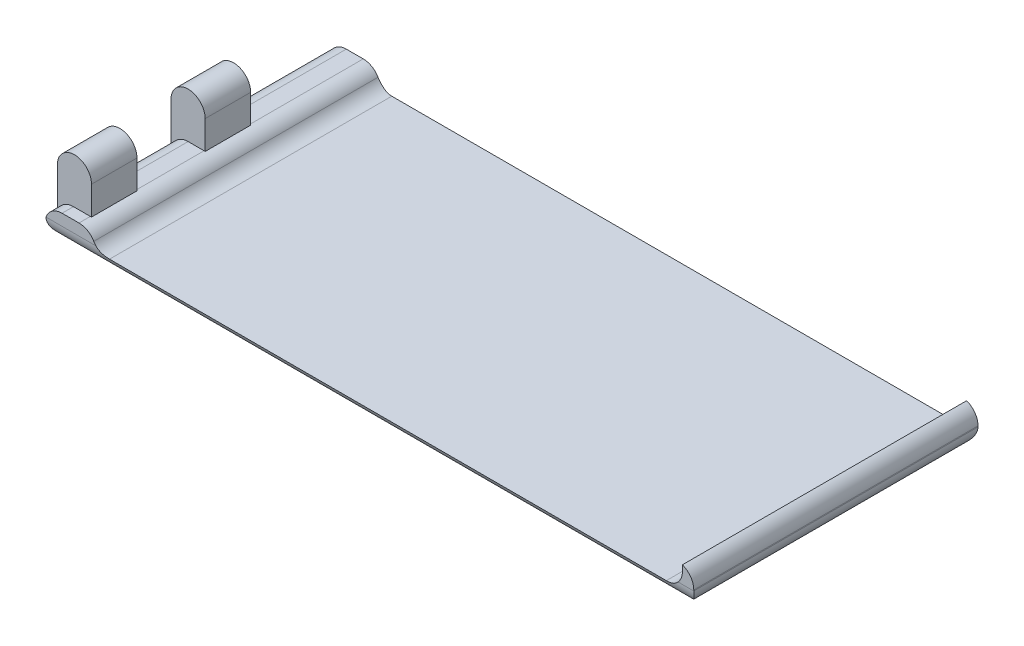
ISO-10303-21;
HEADER;
FILE_DESCRIPTION(('STEP AP214'),'2;1');
FILE_NAME('part.step','',(''),(''),'','','');
FILE_SCHEMA(('AUTOMOTIVE_DESIGN { 1 0 10303 214 1 1 1 1 }'));
ENDSEC;
DATA;
#1=APPLICATION_CONTEXT('core data for automotive mechanical design processes');
#2=APPLICATION_PROTOCOL_DEFINITION('international standard','automotive_design',2000,#1);
#3=PRODUCT_CONTEXT('',#1,'mechanical');
#4=PRODUCT('Part','Part','',(#3));
#5=PRODUCT_RELATED_PRODUCT_CATEGORY('part','',(#4));
#6=PRODUCT_DEFINITION_FORMATION('','',#4);
#7=PRODUCT_DEFINITION_CONTEXT('part definition',#1,'design');
#8=PRODUCT_DEFINITION('design','',#6,#7);
#9=PRODUCT_DEFINITION_SHAPE('','',#8);
#10=(LENGTH_UNIT() NAMED_UNIT(*) SI_UNIT(.MILLI.,.METRE.));
#11=(NAMED_UNIT(*) PLANE_ANGLE_UNIT() SI_UNIT($,.RADIAN.));
#12=(NAMED_UNIT(*) SI_UNIT($,.STERADIAN.) SOLID_ANGLE_UNIT());
#13=UNCERTAINTY_MEASURE_WITH_UNIT(LENGTH_MEASURE(1.E-05),#10,'distance_accuracy_value','');
#14=(GEOMETRIC_REPRESENTATION_CONTEXT(3) GLOBAL_UNCERTAINTY_ASSIGNED_CONTEXT((#13)) GLOBAL_UNIT_ASSIGNED_CONTEXT((#10,
#11,#12)) REPRESENTATION_CONTEXT('',''));
#15=CARTESIAN_POINT('',(0.,0.,0.));
#16=DIRECTION('',(0.,0.,1.));
#17=DIRECTION('',(1.,0.,0.));
#18=AXIS2_PLACEMENT_3D('',#15,#16,#17);
#19=CARTESIAN_POINT('',(-56.975,2.,-25.));
#20=DIRECTION('',(1.,0.,0.));
#21=DIRECTION('',(0.,0.,-1.));
#22=AXIS2_PLACEMENT_3D('',#19,#20,#21);
#23=PLANE('',#22);
#24=DIRECTION('',(0.,0.,1.));
#25=VECTOR('',#24,1.);
#26=CARTESIAN_POINT('',(-56.975,3.,-25.));
#27=LINE('',#26,#25);
#28=CARTESIAN_POINT('',(-56.975,3.,15.));
#29=VERTEX_POINT('',#28);
#30=CARTESIAN_POINT('',(-56.975,3.,23.));
#31=VERTEX_POINT('',#30);
#32=EDGE_CURVE('E471',#29,#31,#27,.T.);
#33=ORIENTED_EDGE('',*,*,#32,.T.);
#34=DIRECTION('',(0.,-1.,0.));
#35=VECTOR('',#34,1.);
#36=CARTESIAN_POINT('',(-56.975,13.,23.));
#37=LINE('',#36,#35);
#38=CARTESIAN_POINT('',(-56.975,10.,23.));
#39=VERTEX_POINT('',#38);
#40=EDGE_CURVE('E614',#39,#31,#37,.T.);
#41=ORIENTED_EDGE('',*,*,#40,.F.);
#42=DIRECTION('',(0.,0.,1.));
#43=VECTOR('',#42,1.);
#44=CARTESIAN_POINT('',(-56.975,10.,15.));
#45=LINE('',#44,#43);
#46=CARTESIAN_POINT('',(-56.975,10.,15.));
#47=VERTEX_POINT('',#46);
#48=EDGE_CURVE('E279',#39,#47,#45,.F.);
#49=ORIENTED_EDGE('',*,*,#48,.T.);
#50=DIRECTION('',(0.,-1.,0.));
#51=VECTOR('',#50,1.);
#52=CARTESIAN_POINT('',(-56.975,13.,15.));
#53=LINE('',#52,#51);
#54=EDGE_CURVE('E600',#47,#29,#53,.T.);
#55=ORIENTED_EDGE('',*,*,#54,.T.);
#56=EDGE_LOOP('',(#33,#41,#49,#55));
#57=FACE_BOUND('',#56,.T.);
#58=ADVANCED_FACE('F40',(#57),#23,.F.);
#59=CARTESIAN_POINT('',(0.,5.,0.));
#60=DIRECTION('',(0.,1.,0.));
#61=DIRECTION('',(0.,0.,1.));
#62=AXIS2_PLACEMENT_3D('',#59,#60,#61);
#63=PLANE('',#62);
#64=DIRECTION('',(1.,0.,0.));
#65=VECTOR('',#64,1.);
#66=CARTESIAN_POINT('',(-56.975,5.,23.));
#67=LINE('',#66,#65);
#68=CARTESIAN_POINT('',(-54.1465728752538,5.,23.));
#69=VERTEX_POINT('',#68);
#70=CARTESIAN_POINT('',(-51.1711524227066,5.,23.));
#71=VERTEX_POINT('',#70);
#72=EDGE_CURVE('E591',#69,#71,#67,.T.);
#73=ORIENTED_EDGE('',*,*,#72,.F.);
#74=DIRECTION('',(0.,0.,-1.));
#75=VECTOR('',#74,1.);
#76=CARTESIAN_POINT('',(-54.1465728752538,5.,25.));
#77=LINE('',#76,#75);
#78=CARTESIAN_POINT('',(-54.1465728752538,5.,25.));
#79=VERTEX_POINT('',#78);
#80=EDGE_CURVE('E509',#69,#79,#77,.F.);
#81=ORIENTED_EDGE('',*,*,#80,.T.);
#82=DIRECTION('',(1.,0.,0.));
#83=VECTOR('',#82,1.);
#84=CARTESIAN_POINT('',(-56.975,5.,25.));
#85=LINE('',#84,#83);
#86=CARTESIAN_POINT('',(-51.1711524227066,5.,25.));
#87=VERTEX_POINT('',#86);
#88=EDGE_CURVE('E232',#79,#87,#85,.T.);
#89=ORIENTED_EDGE('',*,*,#88,.T.);
#90=DIRECTION('',(0.,0.,1.));
#91=VECTOR('',#90,1.);
#92=CARTESIAN_POINT('',(-51.1711524227066,5.,-25.));
#93=LINE('',#92,#91);
#94=EDGE_CURVE('E584',#87,#71,#93,.F.);
#95=ORIENTED_EDGE('',*,*,#94,.T.);
#96=EDGE_LOOP('',(#73,#81,#89,#95));
#97=FACE_BOUND('',#96,.T.);
#98=ADVANCED_FACE('F434',(#97),#63,.T.);
#99=DIRECTION('',(-1.,0.,0.));
#100=VECTOR('',#99,1.);
#101=CARTESIAN_POINT('',(-56.975,5.,15.));
#102=LINE('',#101,#100);
#103=CARTESIAN_POINT('',(-51.1711524227066,5.,15.));
#104=VERTEX_POINT('',#103);
#105=CARTESIAN_POINT('',(-53.975,5.,15.));
#106=VERTEX_POINT('',#105);
#107=EDGE_CURVE('E594',#104,#106,#102,.T.);
#108=ORIENTED_EDGE('',*,*,#107,.F.);
#109=DIRECTION('',(0.,0.,1.));
#110=VECTOR('',#109,1.);
#111=CARTESIAN_POINT('',(-51.1711524227066,5.,-25.));
#112=LINE('',#111,#110);
#113=CARTESIAN_POINT('',(-51.1711524227066,5.,3.));
#114=VERTEX_POINT('',#113);
#115=EDGE_CURVE('E581',#104,#114,#112,.F.);
#116=ORIENTED_EDGE('',*,*,#115,.T.);
#117=DIRECTION('',(1.,0.,0.));
#118=VECTOR('',#117,1.);
#119=CARTESIAN_POINT('',(-56.975,5.,3.));
#120=LINE('',#119,#118);
#121=CARTESIAN_POINT('',(-53.975,5.,3.));
#122=VERTEX_POINT('',#121);
#123=EDGE_CURVE('E622',#122,#114,#120,.T.);
#124=ORIENTED_EDGE('',*,*,#123,.F.);
#125=DIRECTION('',(0.,0.,1.));
#126=VECTOR('',#125,1.);
#127=CARTESIAN_POINT('',(-53.975,5.,15.));
#128=LINE('',#127,#126);
#129=EDGE_CURVE('E572',#122,#106,#128,.T.);
#130=ORIENTED_EDGE('',*,*,#129,.T.);
#131=EDGE_LOOP('',(#108,#116,#124,#130));
#132=FACE_BOUND('',#131,.T.);
#133=ADVANCED_FACE('F441',(#132),#63,.T.);
#134=CARTESIAN_POINT('',(-56.975,2.,25.));
#135=DIRECTION('',(0.,0.,-1.));
#136=DIRECTION('',(-1.,0.,0.));
#137=AXIS2_PLACEMENT_3D('',#134,#135,#136);
#138=PLANE('',#137);
#139=ORIENTED_EDGE('',*,*,#88,.F.);
#140=CARTESIAN_POINT('',(-54.1465728752538,2.,25.));
#141=DIRECTION('',(0.,0.,-1.));
#142=DIRECTION('',(-1.,0.,0.));
#143=AXIS2_PLACEMENT_3D('',#140,#141,#142);
#144=CIRCLE('',#143,3.);
#145=CARTESIAN_POINT('',(-56.975,3.,25.));
#146=VERTEX_POINT('',#145);
#147=EDGE_CURVE('E480',#79,#146,#144,.F.);
#148=ORIENTED_EDGE('',*,*,#147,.T.);
#149=DIRECTION('',(1.,0.,0.));
#150=VECTOR('',#149,1.);
#151=CARTESIAN_POINT('',(-56.975,3.,25.));
#152=LINE('',#151,#150);
#153=CARTESIAN_POINT('',(-48.2110679774998,3.,25.));
#154=VERTEX_POINT('',#153);
#155=EDGE_CURVE('E326',#146,#154,#152,.T.);
#156=ORIENTED_EDGE('',*,*,#155,.T.);
#157=CARTESIAN_POINT('',(-45.975,5.,25.));
#158=DIRECTION('',(0.,0.,-1.));
#159=DIRECTION('',(-1.,0.,0.));
#160=AXIS2_PLACEMENT_3D('',#157,#158,#159);
#161=CIRCLE('',#160,3.);
#162=CARTESIAN_POINT('',(-48.5730762113533,3.5,25.));
#163=VERTEX_POINT('',#162);
#164=EDGE_CURVE('E499',#154,#163,#161,.T.);
#165=ORIENTED_EDGE('',*,*,#164,.T.);
#166=CARTESIAN_POINT('',(-51.1711524227066,2.,25.));
#167=DIRECTION('',(0.,0.,-1.));
#168=DIRECTION('',(-1.,0.,0.));
#169=AXIS2_PLACEMENT_3D('',#166,#167,#168);
#170=CIRCLE('',#169,3.);
#171=EDGE_CURVE('E503',#163,#87,#170,.F.);
#172=ORIENTED_EDGE('',*,*,#171,.T.);
#173=EDGE_LOOP('',(#139,#148,#156,#165,#172));
#174=FACE_BOUND('',#173,.T.);
#175=ADVANCED_FACE('F458',(#174),#138,.F.);
#176=CARTESIAN_POINT('',(-56.975,2.,-25.));
#177=DIRECTION('',(0.,0.,1.));
#178=DIRECTION('',(1.,0.,0.));
#179=AXIS2_PLACEMENT_3D('',#176,#177,#178);
#180=PLANE('',#179);
#181=DIRECTION('',(0.,-1.,0.));
#182=VECTOR('',#181,1.);
#183=CARTESIAN_POINT('',(54.975,6.,-25.));
#184=LINE('',#183,#182);
#185=CARTESIAN_POINT('',(54.975,6.,-25.));
#186=VERTEX_POINT('',#185);
#187=CARTESIAN_POINT('',(54.975,5.,-25.));
#188=VERTEX_POINT('',#187);
#189=EDGE_CURVE('E224',#186,#188,#184,.T.);
#190=ORIENTED_EDGE('',*,*,#189,.F.);
#191=CARTESIAN_POINT('',(53.975,3.17157287525381,-25.));
#192=DIRECTION('',(0.,0.,1.));
#193=DIRECTION('',(1.,0.,0.));
#194=AXIS2_PLACEMENT_3D('',#191,#192,#193);
#195=CIRCLE('',#194,3.);
#196=CARTESIAN_POINT('',(56.975,3.17157287525381,-25.));
#197=VERTEX_POINT('',#196);
#198=EDGE_CURVE('E63',#186,#197,#195,.F.);
#199=ORIENTED_EDGE('',*,*,#198,.T.);
#200=DIRECTION('',(0.,-1.,0.));
#201=VECTOR('',#200,1.);
#202=CARTESIAN_POINT('',(56.975,2.,-25.));
#203=LINE('',#202,#201);
#204=CARTESIAN_POINT('',(56.975,3.,-25.));
#205=VERTEX_POINT('',#204);
#206=EDGE_CURVE('E258',#197,#205,#203,.T.);
#207=ORIENTED_EDGE('',*,*,#206,.T.);
#208=DIRECTION('',(-1.,0.,0.));
#209=VECTOR('',#208,1.);
#210=CARTESIAN_POINT('',(-56.975,3.,-25.));
#211=LINE('',#210,#209);
#212=CARTESIAN_POINT('',(54.2110679774998,3.,-25.));
#213=VERTEX_POINT('',#212);
#214=EDGE_CURVE('E292',#205,#213,#211,.T.);
#215=ORIENTED_EDGE('',*,*,#214,.T.);
#216=CARTESIAN_POINT('',(51.975,5.,-25.));
#217=DIRECTION('',(0.,0.,1.));
#218=DIRECTION('',(1.,0.,0.));
#219=AXIS2_PLACEMENT_3D('',#216,#217,#218);
#220=CIRCLE('',#219,3.);
#221=EDGE_CURVE('E227',#213,#188,#220,.T.);
#222=ORIENTED_EDGE('',*,*,#221,.T.);
#223=EDGE_LOOP('',(#190,#199,#207,#215,#222));
#224=FACE_BOUND('',#223,.T.);
#225=ADVANCED_FACE('F225',(#224),#180,.F.);
#226=CARTESIAN_POINT('',(-53.975,10.,15.));
#227=DIRECTION('',(0.,0.,-1.));
#228=DIRECTION('',(-1.,0.,0.));
#229=AXIS2_PLACEMENT_3D('',#226,#227,#228);
#230=CYLINDRICAL_SURFACE('',#229,3.);
#231=DIRECTION('',(0.,0.,1.));
#232=VECTOR('',#231,1.);
#233=CARTESIAN_POINT('',(-50.975,10.,15.));
#234=LINE('',#233,#232);
#235=CARTESIAN_POINT('',(-50.975,10.,15.));
#236=VERTEX_POINT('',#235);
#237=CARTESIAN_POINT('',(-50.975,10.,23.));
#238=VERTEX_POINT('',#237);
#239=EDGE_CURVE('E275',#236,#238,#234,.T.);
#240=ORIENTED_EDGE('',*,*,#239,.F.);
#241=CARTESIAN_POINT('',(-53.975,10.,15.));
#242=DIRECTION('',(0.,0.,1.));
#243=DIRECTION('',(1.,0.,0.));
#244=AXIS2_PLACEMENT_3D('',#241,#242,#243);
#245=CIRCLE('',#244,3.);
#246=EDGE_CURVE('E283',#47,#236,#245,.F.);
#247=ORIENTED_EDGE('',*,*,#246,.F.);
#248=ORIENTED_EDGE('',*,*,#48,.F.);
#249=CARTESIAN_POINT('',(-53.975,10.,23.));
#250=DIRECTION('',(0.,0.,-1.));
#251=DIRECTION('',(-1.,0.,0.));
#252=AXIS2_PLACEMENT_3D('',#249,#250,#251);
#253=CIRCLE('',#252,3.);
#254=EDGE_CURVE('E286',#238,#39,#253,.F.);
#255=ORIENTED_EDGE('',*,*,#254,.F.);
#256=EDGE_LOOP('',(#240,#247,#248,#255));
#257=FACE_BOUND('',#256,.T.);
#258=ADVANCED_FACE('F388',(#257),#230,.T.);
#259=DIRECTION('',(-1.,0.,0.));
#260=VECTOR('',#259,1.);
#261=CARTESIAN_POINT('',(-56.975,5.,-5.));
#262=LINE('',#261,#260);
#263=CARTESIAN_POINT('',(-51.1711524227066,5.,-5.));
#264=VERTEX_POINT('',#263);
#265=CARTESIAN_POINT('',(-54.1465728752538,5.,-5.));
#266=VERTEX_POINT('',#265);
#267=EDGE_CURVE('E564',#264,#266,#262,.T.);
#268=ORIENTED_EDGE('',*,*,#267,.F.);
#269=DIRECTION('',(0.,0.,1.));
#270=VECTOR('',#269,1.);
#271=CARTESIAN_POINT('',(-51.1711524227066,5.,-25.));
#272=LINE('',#271,#270);
#273=CARTESIAN_POINT('',(-51.1711524227066,5.,-25.));
#274=VERTEX_POINT('',#273);
#275=EDGE_CURVE('E576',#264,#274,#272,.F.);
#276=ORIENTED_EDGE('',*,*,#275,.T.);
#277=DIRECTION('',(-1.,0.,0.));
#278=VECTOR('',#277,1.);
#279=CARTESIAN_POINT('',(-56.975,5.,-25.));
#280=LINE('',#279,#278);
#281=CARTESIAN_POINT('',(-54.1465728752538,5.,-25.));
#282=VERTEX_POINT('',#281);
#283=EDGE_CURVE('E251',#274,#282,#280,.T.);
#284=ORIENTED_EDGE('',*,*,#283,.T.);
#285=DIRECTION('',(0.,0.,-1.));
#286=VECTOR('',#285,1.);
#287=CARTESIAN_POINT('',(-54.1465728752538,5.,-5.));
#288=LINE('',#287,#286);
#289=EDGE_CURVE('E567',#282,#266,#288,.F.);
#290=ORIENTED_EDGE('',*,*,#289,.T.);
#291=EDGE_LOOP('',(#268,#276,#284,#290));
#292=FACE_BOUND('',#291,.T.);
#293=ADVANCED_FACE('F444',(#292),#63,.T.);
#294=CARTESIAN_POINT('',(-53.975,10.,-5.));
#295=DIRECTION('',(0.,0.,-1.));
#296=DIRECTION('',(-1.,0.,0.));
#297=AXIS2_PLACEMENT_3D('',#294,#295,#296);
#298=CYLINDRICAL_SURFACE('',#297,3.);
#299=DIRECTION('',(0.,0.,1.));
#300=VECTOR('',#299,1.);
#301=CARTESIAN_POINT('',(-50.975,10.,-5.));
#302=LINE('',#301,#300);
#303=CARTESIAN_POINT('',(-50.975,10.,-5.));
#304=VERTEX_POINT('',#303);
#305=CARTESIAN_POINT('',(-50.975,10.,3.));
#306=VERTEX_POINT('',#305);
#307=EDGE_CURVE('E261',#304,#306,#302,.T.);
#308=ORIENTED_EDGE('',*,*,#307,.F.);
#309=CARTESIAN_POINT('',(-53.975,10.,-5.));
#310=DIRECTION('',(0.,0.,1.));
#311=DIRECTION('',(1.,0.,0.));
#312=AXIS2_PLACEMENT_3D('',#309,#310,#311);
#313=CIRCLE('',#312,3.);
#314=CARTESIAN_POINT('',(-56.975,10.,-5.));
#315=VERTEX_POINT('',#314);
#316=EDGE_CURVE('E269',#315,#304,#313,.F.);
#317=ORIENTED_EDGE('',*,*,#316,.F.);
#318=DIRECTION('',(0.,0.,1.));
#319=VECTOR('',#318,1.);
#320=CARTESIAN_POINT('',(-56.975,10.,-5.));
#321=LINE('',#320,#319);
#322=CARTESIAN_POINT('',(-56.975,10.,3.));
#323=VERTEX_POINT('',#322);
#324=EDGE_CURVE('E265',#323,#315,#321,.F.);
#325=ORIENTED_EDGE('',*,*,#324,.F.);
#326=CARTESIAN_POINT('',(-53.975,10.,3.));
#327=DIRECTION('',(0.,0.,-1.));
#328=DIRECTION('',(-1.,0.,0.));
#329=AXIS2_PLACEMENT_3D('',#326,#327,#328);
#330=CIRCLE('',#329,3.);
#331=EDGE_CURVE('E272',#306,#323,#330,.F.);
#332=ORIENTED_EDGE('',*,*,#331,.F.);
#333=EDGE_LOOP('',(#308,#317,#325,#332));
#334=FACE_BOUND('',#333,.T.);
#335=ADVANCED_FACE('F651',(#334),#298,.T.);
#336=CARTESIAN_POINT('',(0.,2.,0.));
#337=DIRECTION('',(0.,1.,0.));
#338=DIRECTION('',(0.,0.,1.));
#339=AXIS2_PLACEMENT_3D('',#336,#337,#338);
#340=PLANE('',#339);
#341=DIRECTION('',(-1.,0.,0.));
#342=VECTOR('',#341,1.);
#343=CARTESIAN_POINT('',(54.975,2.,-24.8284271247462));
#344=LINE('',#343,#342);
#345=CARTESIAN_POINT('',(51.975,2.,-24.8284271247462));
#346=VERTEX_POINT('',#345);
#347=CARTESIAN_POINT('',(-45.975,2.,-24.8284271247462));
#348=VERTEX_POINT('',#347);
#349=EDGE_CURVE('E299',#346,#348,#344,.T.);
#350=ORIENTED_EDGE('',*,*,#349,.T.);
#351=DIRECTION('',(0.,0.,-1.));
#352=VECTOR('',#351,1.);
#353=CARTESIAN_POINT('',(-45.975,2.,0.));
#354=LINE('',#353,#352);
#355=CARTESIAN_POINT('',(-45.975,2.,24.8284271247462));
#356=VERTEX_POINT('',#355);
#357=EDGE_CURVE('E352',#348,#356,#354,.F.);
#358=ORIENTED_EDGE('',*,*,#357,.T.);
#359=DIRECTION('',(1.,0.,0.));
#360=VECTOR('',#359,1.);
#361=CARTESIAN_POINT('',(-48.975,2.,24.8284271247462));
#362=LINE('',#361,#360);
#363=CARTESIAN_POINT('',(51.975,2.,24.8284271247462));
#364=VERTEX_POINT('',#363);
#365=EDGE_CURVE('E295',#356,#364,#362,.T.);
#366=ORIENTED_EDGE('',*,*,#365,.T.);
#367=DIRECTION('',(0.,0.,1.));
#368=VECTOR('',#367,1.);
#369=CARTESIAN_POINT('',(51.975,2.,0.));
#370=LINE('',#369,#368);
#371=EDGE_CURVE('E333',#364,#346,#370,.F.);
#372=ORIENTED_EDGE('',*,*,#371,.T.);
#373=EDGE_LOOP('',(#350,#358,#366,#372));
#374=FACE_BOUND('',#373,.T.);
#375=ADVANCED_FACE('F694',(#374),#340,.T.);
#376=CARTESIAN_POINT('',(56.975,2.,-25.));
#377=DIRECTION('',(-1.,0.,0.));
#378=DIRECTION('',(0.,0.,1.));
#379=AXIS2_PLACEMENT_3D('',#376,#377,#378);
#380=PLANE('',#379);
#381=ORIENTED_EDGE('',*,*,#206,.F.);
#382=DIRECTION('',(0.,0.,1.));
#383=VECTOR('',#382,1.);
#384=CARTESIAN_POINT('',(56.975,3.17157287525381,-25.));
#385=LINE('',#384,#383);
#386=CARTESIAN_POINT('',(56.975,3.17157287525381,25.));
#387=VERTEX_POINT('',#386);
#388=EDGE_CURVE('E49',#197,#387,#385,.T.);
#389=ORIENTED_EDGE('',*,*,#388,.T.);
#390=DIRECTION('',(0.,-1.,0.));
#391=VECTOR('',#390,1.);
#392=CARTESIAN_POINT('',(56.975,2.,25.));
#393=LINE('',#392,#391);
#394=CARTESIAN_POINT('',(56.975,3.,25.));
#395=VERTEX_POINT('',#394);
#396=EDGE_CURVE('E255',#387,#395,#393,.T.);
#397=ORIENTED_EDGE('',*,*,#396,.T.);
#398=DIRECTION('',(0.,0.,-1.));
#399=VECTOR('',#398,1.);
#400=CARTESIAN_POINT('',(56.975,3.,-25.));
#401=LINE('',#400,#399);
#402=EDGE_CURVE('E329',#395,#205,#401,.T.);
#403=ORIENTED_EDGE('',*,*,#402,.T.);
#404=EDGE_LOOP('',(#381,#389,#397,#403));
#405=FACE_BOUND('',#404,.T.);
#406=ADVANCED_FACE('F459',(#405),#380,.F.);
#407=ORIENTED_EDGE('',*,*,#283,.F.);
#408=CARTESIAN_POINT('',(-51.1711524227066,2.,-25.));
#409=DIRECTION('',(0.,0.,1.));
#410=DIRECTION('',(1.,0.,0.));
#411=AXIS2_PLACEMENT_3D('',#408,#409,#410);
#412=CIRCLE('',#411,3.);
#413=CARTESIAN_POINT('',(-48.5730762113533,3.5,-25.));
#414=VERTEX_POINT('',#413);
#415=EDGE_CURVE('E507',#274,#414,#412,.F.);
#416=ORIENTED_EDGE('',*,*,#415,.T.);
#417=CARTESIAN_POINT('',(-45.975,5.,-25.));
#418=DIRECTION('',(0.,0.,1.));
#419=DIRECTION('',(1.,0.,0.));
#420=AXIS2_PLACEMENT_3D('',#417,#418,#419);
#421=CIRCLE('',#420,3.);
#422=CARTESIAN_POINT('',(-48.2110679774998,3.,-25.));
#423=VERTEX_POINT('',#422);
#424=EDGE_CURVE('E358',#414,#423,#421,.T.);
#425=ORIENTED_EDGE('',*,*,#424,.T.);
#426=DIRECTION('',(-1.,0.,0.));
#427=VECTOR('',#426,1.);
#428=CARTESIAN_POINT('',(-56.975,3.,-25.));
#429=LINE('',#428,#427);
#430=CARTESIAN_POINT('',(-56.975,3.,-25.));
#431=VERTEX_POINT('',#430);
#432=EDGE_CURVE('E289',#423,#431,#429,.T.);
#433=ORIENTED_EDGE('',*,*,#432,.T.);
#434=CARTESIAN_POINT('',(-54.1465728752538,2.,-25.));
#435=DIRECTION('',(0.,0.,1.));
#436=DIRECTION('',(1.,0.,0.));
#437=AXIS2_PLACEMENT_3D('',#434,#435,#436);
#438=CIRCLE('',#437,3.);
#439=EDGE_CURVE('E502',#431,#282,#438,.F.);
#440=ORIENTED_EDGE('',*,*,#439,.T.);
#441=EDGE_LOOP('',(#407,#416,#425,#433,#440));
#442=FACE_BOUND('',#441,.T.);
#443=ADVANCED_FACE('F450',(#442),#180,.F.);
#444=CARTESIAN_POINT('',(-56.975,3.,-5.));
#445=VERTEX_POINT('',#444);
#446=CARTESIAN_POINT('',(-56.975,3.,3.));
#447=VERTEX_POINT('',#446);
#448=EDGE_CURVE('E322',#445,#447,#27,.T.);
#449=ORIENTED_EDGE('',*,*,#448,.T.);
#450=DIRECTION('',(0.,-1.,0.));
#451=VECTOR('',#450,1.);
#452=CARTESIAN_POINT('',(-56.975,13.,3.));
#453=LINE('',#452,#451);
#454=EDGE_CURVE('E239',#323,#447,#453,.T.);
#455=ORIENTED_EDGE('',*,*,#454,.F.);
#456=ORIENTED_EDGE('',*,*,#324,.T.);
#457=DIRECTION('',(0.,-1.,0.));
#458=VECTOR('',#457,1.);
#459=CARTESIAN_POINT('',(-56.975,13.,-5.));
#460=LINE('',#459,#458);
#461=EDGE_CURVE('E465',#315,#445,#460,.T.);
#462=ORIENTED_EDGE('',*,*,#461,.T.);
#463=EDGE_LOOP('',(#449,#455,#456,#462));
#464=FACE_BOUND('',#463,.T.);
#465=ADVANCED_FACE('F437',(#464),#23,.F.);
#466=ORIENTED_EDGE('',*,*,#396,.F.);
#467=CARTESIAN_POINT('',(53.975,3.17157287525381,25.));
#468=DIRECTION('',(0.,0.,-1.));
#469=DIRECTION('',(-1.,0.,0.));
#470=AXIS2_PLACEMENT_3D('',#467,#468,#469);
#471=CIRCLE('',#470,3.);
#472=CARTESIAN_POINT('',(54.975,6.,25.));
#473=VERTEX_POINT('',#472);
#474=EDGE_CURVE('E11',#387,#473,#471,.F.);
#475=ORIENTED_EDGE('',*,*,#474,.T.);
#476=DIRECTION('',(0.,-1.,0.));
#477=VECTOR('',#476,1.);
#478=CARTESIAN_POINT('',(54.975,6.,25.));
#479=LINE('',#478,#477);
#480=CARTESIAN_POINT('',(54.975,5.,25.));
#481=VERTEX_POINT('',#480);
#482=EDGE_CURVE('E233',#473,#481,#479,.T.);
#483=ORIENTED_EDGE('',*,*,#482,.T.);
#484=CARTESIAN_POINT('',(51.975,5.,25.));
#485=DIRECTION('',(0.,0.,-1.));
#486=DIRECTION('',(-1.,0.,0.));
#487=AXIS2_PLACEMENT_3D('',#484,#485,#486);
#488=CIRCLE('',#487,3.);
#489=CARTESIAN_POINT('',(54.2110679774998,3.,25.));
#490=VERTEX_POINT('',#489);
#491=EDGE_CURVE('E686',#481,#490,#488,.T.);
#492=ORIENTED_EDGE('',*,*,#491,.T.);
#493=DIRECTION('',(1.,0.,0.));
#494=VECTOR('',#493,1.);
#495=CARTESIAN_POINT('',(-56.975,3.,25.));
#496=LINE('',#495,#494);
#497=EDGE_CURVE('E321',#490,#395,#496,.T.);
#498=ORIENTED_EDGE('',*,*,#497,.T.);
#499=EDGE_LOOP('',(#466,#475,#483,#492,#498));
#500=FACE_BOUND('',#499,.T.);
#501=ADVANCED_FACE('F449',(#500),#138,.F.);
#502=CARTESIAN_POINT('',(0.,0.,0.));
#503=DIRECTION('',(0.,1.,0.));
#504=DIRECTION('',(0.,0.,1.));
#505=AXIS2_PLACEMENT_3D('',#502,#503,#504);
#506=PLANE('',#505);
#507=DIRECTION('',(0.,0.,1.));
#508=VECTOR('',#507,1.);
#509=CARTESIAN_POINT('',(-53.975,0.,0.));
#510=LINE('',#509,#508);
#511=CARTESIAN_POINT('',(-53.975,0.,22.));
#512=VERTEX_POINT('',#511);
#513=CARTESIAN_POINT('',(-53.975,0.,-22.));
#514=VERTEX_POINT('',#513);
#515=EDGE_CURVE('E309',#512,#514,#510,.F.);
#516=ORIENTED_EDGE('',*,*,#515,.T.);
#517=DIRECTION('',(-1.,0.,0.));
#518=VECTOR('',#517,1.);
#519=CARTESIAN_POINT('',(0.,0.,-22.));
#520=LINE('',#519,#518);
#521=CARTESIAN_POINT('',(53.975,0.,-22.));
#522=VERTEX_POINT('',#521);
#523=EDGE_CURVE('E312',#514,#522,#520,.F.);
#524=ORIENTED_EDGE('',*,*,#523,.T.);
#525=DIRECTION('',(0.,0.,-1.));
#526=VECTOR('',#525,1.);
#527=CARTESIAN_POINT('',(53.975,0.,0.));
#528=LINE('',#527,#526);
#529=CARTESIAN_POINT('',(53.975,0.,22.));
#530=VERTEX_POINT('',#529);
#531=EDGE_CURVE('E303',#522,#530,#528,.F.);
#532=ORIENTED_EDGE('',*,*,#531,.T.);
#533=DIRECTION('',(1.,0.,0.));
#534=VECTOR('',#533,1.);
#535=CARTESIAN_POINT('',(0.,0.,22.));
#536=LINE('',#535,#534);
#537=EDGE_CURVE('E306',#530,#512,#536,.F.);
#538=ORIENTED_EDGE('',*,*,#537,.T.);
#539=EDGE_LOOP('',(#516,#524,#532,#538));
#540=FACE_BOUND('',#539,.T.);
#541=ADVANCED_FACE('F456',(#540),#506,.F.);
#542=CARTESIAN_POINT('',(54.975,6.,-25.));
#543=DIRECTION('',(1.,0.,0.));
#544=DIRECTION('',(0.,0.,-1.));
#545=AXIS2_PLACEMENT_3D('',#542,#543,#544);
#546=PLANE('',#545);
#547=ORIENTED_EDGE('',*,*,#189,.T.);
#548=DIRECTION('',(0.,0.,1.));
#549=VECTOR('',#548,1.);
#550=CARTESIAN_POINT('',(54.975,5.,-25.));
#551=LINE('',#550,#549);
#552=EDGE_CURVE('E355',#188,#481,#551,.T.);
#553=ORIENTED_EDGE('',*,*,#552,.T.);
#554=ORIENTED_EDGE('',*,*,#482,.F.);
#555=DIRECTION('',(0.,0.,1.));
#556=VECTOR('',#555,1.);
#557=CARTESIAN_POINT('',(54.975,6.,-25.));
#558=LINE('',#557,#556);
#559=EDGE_CURVE('E219',#186,#473,#558,.T.);
#560=ORIENTED_EDGE('',*,*,#559,.F.);
#561=EDGE_LOOP('',(#547,#553,#554,#560));
#562=FACE_BOUND('',#561,.T.);
#563=ADVANCED_FACE('F236',(#562),#546,.F.);
#564=CARTESIAN_POINT('',(-56.975,13.,3.));
#565=DIRECTION('',(0.,0.,-1.));
#566=DIRECTION('',(-1.,0.,0.));
#567=AXIS2_PLACEMENT_3D('',#564,#565,#566);
#568=PLANE('',#567);
#569=DIRECTION('',(0.,-1.,0.));
#570=VECTOR('',#569,1.);
#571=CARTESIAN_POINT('',(-50.975,13.,3.));
#572=LINE('',#571,#570);
#573=CARTESIAN_POINT('',(-50.975,4.99358050285378,3.));
#574=VERTEX_POINT('',#573);
#575=EDGE_CURVE('E244',#306,#574,#572,.T.);
#576=ORIENTED_EDGE('',*,*,#575,.F.);
#577=ORIENTED_EDGE('',*,*,#331,.T.);
#578=ORIENTED_EDGE('',*,*,#454,.T.);
#579=CARTESIAN_POINT('',(-53.975,3.,3.));
#580=DIRECTION('',(0.,0.,-1.));
#581=DIRECTION('',(-1.,0.,0.));
#582=AXIS2_PLACEMENT_3D('',#579,#580,#581);
#583=CIRCLE('',#582,3.);
#584=CARTESIAN_POINT('',(-56.9330398915498,2.5,3.));
#585=VERTEX_POINT('',#584);
#586=EDGE_CURVE('E522',#585,#447,#583,.T.);
#587=ORIENTED_EDGE('',*,*,#586,.F.);
#588=CARTESIAN_POINT('',(-53.975,2.,3.));
#589=DIRECTION('',(0.,0.,-1.));
#590=DIRECTION('',(-1.,0.,0.));
#591=AXIS2_PLACEMENT_3D('',#588,#589,#590);
#592=CIRCLE('',#591,3.);
#593=EDGE_CURVE('E555',#585,#122,#592,.T.);
#594=ORIENTED_EDGE('',*,*,#593,.T.);
#595=ORIENTED_EDGE('',*,*,#123,.T.);
#596=CARTESIAN_POINT('',(-51.1711524227066,2.,3.));
#597=DIRECTION('',(0.,0.,-1.));
#598=DIRECTION('',(-1.,0.,0.));
#599=AXIS2_PLACEMENT_3D('',#596,#597,#598);
#600=CIRCLE('',#599,3.);
#601=EDGE_CURVE('E541',#114,#574,#600,.T.);
#602=ORIENTED_EDGE('',*,*,#601,.T.);
#603=EDGE_LOOP('',(#576,#577,#578,#587,#594,#595,#602));
#604=FACE_BOUND('',#603,.T.);
#605=ADVANCED_FACE('F645',(#604),#568,.F.);
#606=CARTESIAN_POINT('',(-50.975,13.,-5.));
#607=DIRECTION('',(-1.,0.,0.));
#608=DIRECTION('',(0.,0.,1.));
#609=AXIS2_PLACEMENT_3D('',#606,#607,#608);
#610=PLANE('',#609);
#611=DIRECTION('',(0.,-1.,0.));
#612=VECTOR('',#611,1.);
#613=CARTESIAN_POINT('',(-50.975,13.,-5.));
#614=LINE('',#613,#612);
#615=CARTESIAN_POINT('',(-50.975,4.99358050285378,-5.));
#616=VERTEX_POINT('',#615);
#617=EDGE_CURVE('E633',#304,#616,#614,.T.);
#618=ORIENTED_EDGE('',*,*,#617,.F.);
#619=ORIENTED_EDGE('',*,*,#307,.T.);
#620=ORIENTED_EDGE('',*,*,#575,.T.);
#621=DIRECTION('',(0.,0.,-1.));
#622=VECTOR('',#621,1.);
#623=CARTESIAN_POINT('',(-50.975,4.99358050285378,3.));
#624=LINE('',#623,#622);
#625=EDGE_CURVE('E545',#574,#616,#624,.T.);
#626=ORIENTED_EDGE('',*,*,#625,.T.);
#627=EDGE_LOOP('',(#618,#619,#620,#626));
#628=FACE_BOUND('',#627,.T.);
#629=ADVANCED_FACE('F639',(#628),#610,.F.);
#630=CARTESIAN_POINT('',(-56.975,13.,-5.));
#631=DIRECTION('',(0.,0.,1.));
#632=DIRECTION('',(1.,0.,0.));
#633=AXIS2_PLACEMENT_3D('',#630,#631,#632);
#634=PLANE('',#633);
#635=CARTESIAN_POINT('',(-53.975,10.,-5.));
#636=DIRECTION('',(0.,0.,-1.));
#637=DIRECTION('',(-1.,0.,0.));
#638=AXIS2_PLACEMENT_3D('',#635,#636,#637);
#639=CIRCLE('',#638,1.525);
#640=CARTESIAN_POINT('',(-55.5,10.,-5.));
#641=VERTEX_POINT('',#640);
#642=EDGE_CURVE('E617',#641,#641,#639,.T.);
#643=ORIENTED_EDGE('',*,*,#642,.F.);
#644=EDGE_LOOP('',(#643));
#645=FACE_BOUND('',#644,.T.);
#646=ORIENTED_EDGE('',*,*,#461,.F.);
#647=ORIENTED_EDGE('',*,*,#316,.T.);
#648=ORIENTED_EDGE('',*,*,#617,.T.);
#649=CARTESIAN_POINT('',(-51.1711524227066,2.,-5.));
#650=DIRECTION('',(0.,0.,1.));
#651=DIRECTION('',(1.,0.,0.));
#652=AXIS2_PLACEMENT_3D('',#649,#650,#651);
#653=CIRCLE('',#652,3.);
#654=EDGE_CURVE('E549',#616,#264,#653,.T.);
#655=ORIENTED_EDGE('',*,*,#654,.T.);
#656=ORIENTED_EDGE('',*,*,#267,.T.);
#657=CARTESIAN_POINT('',(-54.1465728752538,2.,-5.));
#658=DIRECTION('',(0.,0.,1.));
#659=DIRECTION('',(1.,0.,0.));
#660=AXIS2_PLACEMENT_3D('',#657,#658,#659);
#661=CIRCLE('',#660,3.);
#662=EDGE_CURVE('E221',#266,#445,#661,.T.);
#663=ORIENTED_EDGE('',*,*,#662,.T.);
#664=EDGE_LOOP('',(#646,#647,#648,#655,#656,#663));
#665=FACE_BOUND('',#664,.T.);
#666=ADVANCED_FACE('F562',(#645,#665),#634,.F.);
#667=CARTESIAN_POINT('',(-53.975,10.,-3.));
#668=DIRECTION('',(0.,0.,-1.));
#669=DIRECTION('',(-1.,0.,0.));
#670=AXIS2_PLACEMENT_3D('',#667,#668,#669);
#671=CYLINDRICAL_SURFACE('',#670,1.525);
#672=CARTESIAN_POINT('',(-53.975,10.,-3.));
#673=DIRECTION('',(0.,0.,-1.));
#674=DIRECTION('',(-1.,0.,0.));
#675=AXIS2_PLACEMENT_3D('',#672,#673,#674);
#676=CIRCLE('',#675,1.525);
#677=CARTESIAN_POINT('',(-55.5,10.,-3.));
#678=VERTEX_POINT('',#677);
#679=EDGE_CURVE('E618',#678,#678,#676,.T.);
#680=ORIENTED_EDGE('',*,*,#679,.F.);
#681=EDGE_LOOP('',(#680));
#682=FACE_BOUND('',#681,.T.);
#683=ORIENTED_EDGE('',*,*,#642,.T.);
#684=EDGE_LOOP('',(#683));
#685=FACE_BOUND('',#684,.T.);
#686=ADVANCED_FACE('F734',(#682,#685),#671,.F.);
#687=CARTESIAN_POINT('',(-53.975,10.,-3.));
#688=DIRECTION('',(0.,0.,-1.));
#689=DIRECTION('',(-1.,0.,0.));
#690=AXIS2_PLACEMENT_3D('',#687,#688,#689);
#691=PLANE('',#690);
#692=ORIENTED_EDGE('',*,*,#679,.T.);
#693=EDGE_LOOP('',(#692));
#694=FACE_BOUND('',#693,.T.);
#695=ADVANCED_FACE('F738',(#694),#691,.T.);
#696=CARTESIAN_POINT('',(-56.975,13.,23.));
#697=DIRECTION('',(0.,0.,-1.));
#698=DIRECTION('',(-1.,0.,0.));
#699=AXIS2_PLACEMENT_3D('',#696,#697,#698);
#700=PLANE('',#699);
#701=DIRECTION('',(0.,-1.,0.));
#702=VECTOR('',#701,1.);
#703=CARTESIAN_POINT('',(-50.975,13.,23.));
#704=LINE('',#703,#702);
#705=CARTESIAN_POINT('',(-50.975,4.99358050285379,23.));
#706=VERTEX_POINT('',#705);
#707=EDGE_CURVE('E611',#238,#706,#704,.T.);
#708=ORIENTED_EDGE('',*,*,#707,.F.);
#709=ORIENTED_EDGE('',*,*,#254,.T.);
#710=ORIENTED_EDGE('',*,*,#40,.T.);
#711=CARTESIAN_POINT('',(-54.1465728752538,2.,23.));
#712=DIRECTION('',(0.,0.,-1.));
#713=DIRECTION('',(-1.,0.,0.));
#714=AXIS2_PLACEMENT_3D('',#711,#712,#713);
#715=CIRCLE('',#714,3.);
#716=EDGE_CURVE('E482',#31,#69,#715,.T.);
#717=ORIENTED_EDGE('',*,*,#716,.T.);
#718=ORIENTED_EDGE('',*,*,#72,.T.);
#719=CARTESIAN_POINT('',(-51.1711524227066,2.,23.));
#720=DIRECTION('',(0.,0.,-1.));
#721=DIRECTION('',(-1.,0.,0.));
#722=AXIS2_PLACEMENT_3D('',#719,#720,#721);
#723=CIRCLE('',#722,3.);
#724=EDGE_CURVE('E530',#71,#706,#723,.T.);
#725=ORIENTED_EDGE('',*,*,#724,.T.);
#726=EDGE_LOOP('',(#708,#709,#710,#717,#718,#725));
#727=FACE_BOUND('',#726,.T.);
#728=ADVANCED_FACE('F668',(#727),#700,.F.);
#729=CARTESIAN_POINT('',(-50.975,13.,15.));
#730=DIRECTION('',(-1.,0.,0.));
#731=DIRECTION('',(0.,0.,1.));
#732=AXIS2_PLACEMENT_3D('',#729,#730,#731);
#733=PLANE('',#732);
#734=DIRECTION('',(0.,-1.,0.));
#735=VECTOR('',#734,1.);
#736=CARTESIAN_POINT('',(-50.975,13.,15.));
#737=LINE('',#736,#735);
#738=CARTESIAN_POINT('',(-50.975,4.99358050285378,15.));
#739=VERTEX_POINT('',#738);
#740=EDGE_CURVE('E608',#236,#739,#737,.T.);
#741=ORIENTED_EDGE('',*,*,#740,.F.);
#742=ORIENTED_EDGE('',*,*,#239,.T.);
#743=ORIENTED_EDGE('',*,*,#707,.T.);
#744=DIRECTION('',(0.,0.,-1.));
#745=VECTOR('',#744,1.);
#746=CARTESIAN_POINT('',(-50.975,4.99358050285379,23.));
#747=LINE('',#746,#745);
#748=EDGE_CURVE('E534',#706,#739,#747,.T.);
#749=ORIENTED_EDGE('',*,*,#748,.T.);
#750=EDGE_LOOP('',(#741,#742,#743,#749));
#751=FACE_BOUND('',#750,.T.);
#752=ADVANCED_FACE('F666',(#751),#733,.F.);
#753=CARTESIAN_POINT('',(-56.975,13.,15.));
#754=DIRECTION('',(0.,0.,1.));
#755=DIRECTION('',(1.,0.,0.));
#756=AXIS2_PLACEMENT_3D('',#753,#754,#755);
#757=PLANE('',#756);
#758=CARTESIAN_POINT('',(-53.975,10.,15.));
#759=DIRECTION('',(0.,0.,-1.));
#760=DIRECTION('',(-1.,0.,0.));
#761=AXIS2_PLACEMENT_3D('',#758,#759,#760);
#762=CIRCLE('',#761,1.525);
#763=CARTESIAN_POINT('',(-55.5,10.,15.));
#764=VERTEX_POINT('',#763);
#765=EDGE_CURVE('E349',#764,#764,#762,.T.);
#766=ORIENTED_EDGE('',*,*,#765,.F.);
#767=EDGE_LOOP('',(#766));
#768=FACE_BOUND('',#767,.T.);
#769=ORIENTED_EDGE('',*,*,#54,.F.);
#770=ORIENTED_EDGE('',*,*,#246,.T.);
#771=ORIENTED_EDGE('',*,*,#740,.T.);
#772=CARTESIAN_POINT('',(-51.1711524227066,2.,15.));
#773=DIRECTION('',(0.,0.,1.));
#774=DIRECTION('',(1.,0.,0.));
#775=AXIS2_PLACEMENT_3D('',#772,#773,#774);
#776=CIRCLE('',#775,3.);
#777=EDGE_CURVE('E538',#739,#104,#776,.T.);
#778=ORIENTED_EDGE('',*,*,#777,.T.);
#779=ORIENTED_EDGE('',*,*,#107,.T.);
#780=CARTESIAN_POINT('',(-53.975,2.,15.));
#781=DIRECTION('',(0.,0.,1.));
#782=DIRECTION('',(1.,0.,0.));
#783=AXIS2_PLACEMENT_3D('',#780,#781,#782);
#784=CIRCLE('',#783,3.);
#785=CARTESIAN_POINT('',(-56.9330398915498,2.5,15.));
#786=VERTEX_POINT('',#785);
#787=EDGE_CURVE('E552',#106,#786,#784,.T.);
#788=ORIENTED_EDGE('',*,*,#787,.T.);
#789=CARTESIAN_POINT('',(-53.975,3.,15.));
#790=DIRECTION('',(0.,0.,1.));
#791=DIRECTION('',(1.,0.,0.));
#792=AXIS2_PLACEMENT_3D('',#789,#790,#791);
#793=CIRCLE('',#792,3.);
#794=EDGE_CURVE('E525',#29,#786,#793,.T.);
#795=ORIENTED_EDGE('',*,*,#794,.F.);
#796=EDGE_LOOP('',(#769,#770,#771,#778,#779,#788,#795));
#797=FACE_BOUND('',#796,.T.);
#798=ADVANCED_FACE('F662',(#768,#797),#757,.F.);
#799=CARTESIAN_POINT('',(-53.975,10.,17.));
#800=DIRECTION('',(0.,0.,-1.));
#801=DIRECTION('',(-1.,0.,0.));
#802=AXIS2_PLACEMENT_3D('',#799,#800,#801);
#803=CYLINDRICAL_SURFACE('',#802,1.525);
#804=CARTESIAN_POINT('',(-53.975,10.,17.));
#805=DIRECTION('',(0.,0.,-1.));
#806=DIRECTION('',(-1.,0.,0.));
#807=AXIS2_PLACEMENT_3D('',#804,#805,#806);
#808=CIRCLE('',#807,1.525);
#809=CARTESIAN_POINT('',(-55.5,10.,17.));
#810=VERTEX_POINT('',#809);
#811=EDGE_CURVE('E595',#810,#810,#808,.T.);
#812=ORIENTED_EDGE('',*,*,#811,.F.);
#813=EDGE_LOOP('',(#812));
#814=FACE_BOUND('',#813,.T.);
#815=ORIENTED_EDGE('',*,*,#765,.T.);
#816=EDGE_LOOP('',(#815));
#817=FACE_BOUND('',#816,.T.);
#818=ADVANCED_FACE('F749',(#814,#817),#803,.F.);
#819=CARTESIAN_POINT('',(-53.975,10.,17.));
#820=DIRECTION('',(0.,0.,-1.));
#821=DIRECTION('',(-1.,0.,0.));
#822=AXIS2_PLACEMENT_3D('',#819,#820,#821);
#823=PLANE('',#822);
#824=ORIENTED_EDGE('',*,*,#811,.T.);
#825=EDGE_LOOP('',(#824));
#826=FACE_BOUND('',#825,.T.);
#827=ADVANCED_FACE('F753',(#826),#823,.T.);
#828=CARTESIAN_POINT('',(-56.975,3.,22.));
#829=DIRECTION('',(1.,0.,0.));
#830=DIRECTION('',(0.,0.,-1.));
#831=AXIS2_PLACEMENT_3D('',#828,#829,#830);
#832=CYLINDRICAL_SURFACE('',#831,3.);
#833=CARTESIAN_POINT('',(-53.975,3.,22.));
#834=DIRECTION('',(0.707106781186547,0.,0.707106781186547));
#835=DIRECTION('',(0.707106781186547,0.,-0.707106781186547));
#836=AXIS2_PLACEMENT_3D('',#833,#834,#835);
#837=ELLIPSE('',#836,4.24264068711928,3.);
#838=EDGE_CURVE('E341',#512,#146,#837,.F.);
#839=ORIENTED_EDGE('',*,*,#838,.F.);
#840=ORIENTED_EDGE('',*,*,#537,.F.);
#841=CARTESIAN_POINT('',(53.975,3.,22.));
#842=DIRECTION('',(0.707106781186547,0.,-0.707106781186547));
#843=DIRECTION('',(-0.707106781186547,0.,-0.707106781186547));
#844=AXIS2_PLACEMENT_3D('',#841,#842,#843);
#845=ELLIPSE('',#844,4.24264068711928,3.);
#846=EDGE_CURVE('E345',#395,#530,#845,.T.);
#847=ORIENTED_EDGE('',*,*,#846,.F.);
#848=ORIENTED_EDGE('',*,*,#497,.F.);
#849=CARTESIAN_POINT('',(54.2110679774998,3.,25.));
#850=CARTESIAN_POINT('',(54.1557267827908,2.93811053358095,24.9999995592573));
#851=CARTESIAN_POINT('',(54.0978283655331,2.87856328045086,24.9980852534358));
#852=CARTESIAN_POINT('',(53.9774379688108,2.76458261346527,24.9912932747583));
#853=CARTESIAN_POINT('',(53.914949579321,2.71014527730868,24.9864178966141));
#854=CARTESIAN_POINT('',(53.7858106417677,2.60671498911223,24.9745652525438));
#855=CARTESIAN_POINT('',(53.7191599426969,2.55772223477945,24.9675879103241));
#856=CARTESIAN_POINT('',(53.582154597975,2.46546243296754,24.9523641002462));
#857=CARTESIAN_POINT('',(53.5117993164952,2.42219637288512,24.9441174140566));
#858=CARTESIAN_POINT('',(53.2960843477774,2.30151520849984,24.9187137100423));
#859=CARTESIAN_POINT('',(53.1457357443442,2.23294588014931,24.900853835377));
#860=CARTESIAN_POINT('',(52.8357036808149,2.12141385232702,24.8690567324753));
#861=CARTESIAN_POINT('',(52.6760378010765,2.0784045375733,24.8551123879219));
#862=CARTESIAN_POINT('',(52.4250535341239,2.03257623367965,24.839782959893));
#863=CARTESIAN_POINT('',(52.3355407478064,2.02037689122973,24.8355700382451));
#864=CARTESIAN_POINT('',(52.1557012958259,2.00408488621236,24.8298733456497));
#865=CARTESIAN_POINT('',(52.0653746753799,1.99999177601592,24.8283894240063));
#866=CARTESIAN_POINT('',(51.975,2.,24.8284271247462));
#867=B_SPLINE_CURVE_WITH_KNOTS('',3,(#849,#850,#851,#852,#853,#854,#855,#856,#857,#858,#859,
#860,#861,#862,#863,#864,#865,#866),.UNSPECIFIED.,.F.,.F.,(4,2,2,2,2,2,2,2,4),(0.,
0.24891770174048,0.497642747979507,0.746376823129679,0.995153729300604,1.49141381632359,
1.98676604521497,2.25770982706082,2.52863864687879),.UNSPECIFIED.);
#868=EDGE_CURVE('E402',#490,#364,#867,.T.);
#869=ORIENTED_EDGE('',*,*,#868,.T.);
#870=ORIENTED_EDGE('',*,*,#365,.F.);
#871=CARTESIAN_POINT('',(-45.975,2.,24.8284271247462));
#872=CARTESIAN_POINT('',(-46.0580586512094,1.99998890651401,24.8283942090751));
#873=CARTESIAN_POINT('',(-46.1411059046161,2.00344900300256,24.8296459359177));
#874=CARTESIAN_POINT('',(-46.3065281627749,2.01722324623583,24.8344746152862));
#875=CARTESIAN_POINT('',(-46.3889034363038,2.02753450135123,24.8380505868177));
#876=CARTESIAN_POINT('',(-46.5523306653099,2.05491068646521,24.8472799719783));
#877=CARTESIAN_POINT('',(-46.6333837327579,2.07196960059203,24.8529315347951));
#878=CARTESIAN_POINT('',(-46.7936674442101,2.11267831879996,24.8658530242337));
#879=CARTESIAN_POINT('',(-46.8728979789537,2.13632851691906,24.8731230476045));
#880=CARTESIAN_POINT('',(-47.1069537152761,2.21686224834923,24.8965246637371));
#881=CARTESIAN_POINT('',(-47.2584111769764,2.28337432759031,24.9142661567854));
#882=CARTESIAN_POINT('',(-47.5482465207292,2.44031002040584,24.9484139899896));
#883=CARTESIAN_POINT('',(-47.6866450500017,2.53069499908538,24.9648224318955));
#884=CARTESIAN_POINT('',(-47.8877899951777,2.68714065665249,24.9841591959993));
#885=CARTESIAN_POINT('',(-47.9563035672565,2.74555394729997,24.9898239399038));
#886=CARTESIAN_POINT('',(-48.0878946107816,2.86838389239051,24.9977428454694));
#887=CARTESIAN_POINT('',(-48.1509732862419,2.93279921056518,24.9999977643639));
#888=CARTESIAN_POINT('',(-48.2110679774998,3.,25.));
#889=B_SPLINE_CURVE_WITH_KNOTS('',3,(#871,#872,#873,#874,#875,#876,#877,#878,#879,#880,#881,
#882,#883,#884,#885,#886,#887,#888),.UNSPECIFIED.,.F.,.F.,(4,2,2,2,2,2,2,2,4),(0.,
0.249075626926632,0.498046194650309,0.746795291304601,0.995559261786962,1.49227977984719,
1.98820130016059,2.25845289457995,2.52864446433387),.UNSPECIFIED.);
#890=EDGE_CURVE('E370',#356,#154,#889,.T.);
#891=ORIENTED_EDGE('',*,*,#890,.T.);
#892=ORIENTED_EDGE('',*,*,#155,.F.);
#893=EDGE_LOOP('',(#839,#840,#847,#848,#869,#870,#891,#892));
#894=FACE_BOUND('',#893,.T.);
#895=ADVANCED_FACE('F490',(#894),#832,.T.);
#896=CARTESIAN_POINT('',(53.975,3.,-25.));
#897=DIRECTION('',(0.,0.,-1.));
#898=DIRECTION('',(-1.,0.,0.));
#899=AXIS2_PLACEMENT_3D('',#896,#897,#898);
#900=CYLINDRICAL_SURFACE('',#899,3.);
#901=ORIENTED_EDGE('',*,*,#846,.T.);
#902=ORIENTED_EDGE('',*,*,#531,.F.);
#903=CARTESIAN_POINT('',(53.975,3.,-22.));
#904=DIRECTION('',(-0.707106781186547,0.,-0.707106781186547));
#905=DIRECTION('',(0.707106781186547,0.,-0.707106781186547));
#906=AXIS2_PLACEMENT_3D('',#903,#904,#905);
#907=ELLIPSE('',#906,4.24264068711928,3.);
#908=EDGE_CURVE('E338',#205,#522,#907,.T.);
#909=ORIENTED_EDGE('',*,*,#908,.F.);
#910=ORIENTED_EDGE('',*,*,#402,.F.);
#911=EDGE_LOOP('',(#901,#902,#909,#910));
#912=FACE_BOUND('',#911,.T.);
#913=ADVANCED_FACE('F682',(#912),#900,.T.);
#914=CARTESIAN_POINT('',(-53.975,3.,-25.));
#915=DIRECTION('',(0.,0.,1.));
#916=DIRECTION('',(1.,0.,0.));
#917=AXIS2_PLACEMENT_3D('',#914,#915,#916);
#918=CYLINDRICAL_SURFACE('',#917,3.);
#919=ORIENTED_EDGE('',*,*,#32,.F.);
#920=ORIENTED_EDGE('',*,*,#794,.T.);
#921=DIRECTION('',(0.,0.,-1.));
#922=VECTOR('',#921,1.);
#923=CARTESIAN_POINT('',(-56.9330398915498,2.5,8.99999999999999));
#924=LINE('',#923,#922);
#925=EDGE_CURVE('E518',#786,#585,#924,.T.);
#926=ORIENTED_EDGE('',*,*,#925,.T.);
#927=ORIENTED_EDGE('',*,*,#586,.T.);
#928=ORIENTED_EDGE('',*,*,#448,.F.);
#929=EDGE_CURVE('E317',#431,#445,#27,.T.);
#930=ORIENTED_EDGE('',*,*,#929,.F.);
#931=CARTESIAN_POINT('',(-53.975,3.,-22.));
#932=DIRECTION('',(-0.707106781186547,0.,0.707106781186547));
#933=DIRECTION('',(0.707106781186547,0.,0.707106781186547));
#934=AXIS2_PLACEMENT_3D('',#931,#932,#933);
#935=ELLIPSE('',#934,4.24264068711928,3.);
#936=EDGE_CURVE('E334',#514,#431,#935,.F.);
#937=ORIENTED_EDGE('',*,*,#936,.F.);
#938=ORIENTED_EDGE('',*,*,#515,.F.);
#939=ORIENTED_EDGE('',*,*,#838,.T.);
#940=EDGE_CURVE('E316',#31,#146,#27,.T.);
#941=ORIENTED_EDGE('',*,*,#940,.F.);
#942=EDGE_LOOP('',(#919,#920,#926,#927,#928,#930,#937,#938,#939,#941));
#943=FACE_BOUND('',#942,.T.);
#944=ADVANCED_FACE('F385',(#943),#918,.T.);
#945=CARTESIAN_POINT('',(-56.975,3.,-22.));
#946=DIRECTION('',(-1.,0.,0.));
#947=DIRECTION('',(0.,0.,1.));
#948=AXIS2_PLACEMENT_3D('',#945,#946,#947);
#949=CYLINDRICAL_SURFACE('',#948,3.);
#950=ORIENTED_EDGE('',*,*,#908,.T.);
#951=ORIENTED_EDGE('',*,*,#523,.F.);
#952=ORIENTED_EDGE('',*,*,#936,.T.);
#953=ORIENTED_EDGE('',*,*,#432,.F.);
#954=CARTESIAN_POINT('',(-48.2110679774998,3.,-25.));
#955=CARTESIAN_POINT('',(-48.1557267827908,2.93811053358095,-24.9999995592573));
#956=CARTESIAN_POINT('',(-48.0978283655331,2.87856328045086,-24.9980852534358));
#957=CARTESIAN_POINT('',(-47.9774379688108,2.76458261346527,-24.9912932747583));
#958=CARTESIAN_POINT('',(-47.914949579321,2.71014527730868,-24.9864178966141));
#959=CARTESIAN_POINT('',(-47.7858106417677,2.60671498911223,-24.9745652525438));
#960=CARTESIAN_POINT('',(-47.7191599426969,2.55772223477945,-24.9675879103241));
#961=CARTESIAN_POINT('',(-47.582154597975,2.46546243296754,-24.9523641002462));
#962=CARTESIAN_POINT('',(-47.5117993164952,2.42219637288512,-24.9441174140566));
#963=CARTESIAN_POINT('',(-47.2960843477774,2.30151520849984,-24.9187137100423));
#964=CARTESIAN_POINT('',(-47.1457357443442,2.23294588014931,-24.900853835377));
#965=CARTESIAN_POINT('',(-46.8357036808149,2.12141385232702,-24.8690567324753));
#966=CARTESIAN_POINT('',(-46.6760378010765,2.0784045375733,-24.8551123879219));
#967=CARTESIAN_POINT('',(-46.4250535341239,2.03257623367965,-24.839782959893));
#968=CARTESIAN_POINT('',(-46.3355407478064,2.02037689122973,-24.8355700382451));
#969=CARTESIAN_POINT('',(-46.155701295826,2.00408488621236,-24.8298733456497));
#970=CARTESIAN_POINT('',(-46.0653746753799,1.99999177601592,-24.8283894240063));
#971=CARTESIAN_POINT('',(-45.975,2.,-24.8284271247462));
#972=B_SPLINE_CURVE_WITH_KNOTS('',3,(#954,#955,#956,#957,#958,#959,#960,#961,#962,#963,#964,
#965,#966,#967,#968,#969,#970,#971),.UNSPECIFIED.,.F.,.F.,(4,2,2,2,2,2,2,2,4),(0.,
0.24891770174048,0.497642747979507,0.746376823129679,0.995153729300604,1.49141381632359,
1.98676604521497,2.25770982706082,2.52863864687879),.UNSPECIFIED.);
#973=EDGE_CURVE('E361',#423,#348,#972,.T.);
#974=ORIENTED_EDGE('',*,*,#973,.T.);
#975=ORIENTED_EDGE('',*,*,#349,.F.);
#976=CARTESIAN_POINT('',(51.975,2.,-24.8284271247462));
#977=CARTESIAN_POINT('',(52.0580586512093,1.99998890651401,-24.8283942090751));
#978=CARTESIAN_POINT('',(52.1411059046161,2.00344900300256,-24.8296459359177));
#979=CARTESIAN_POINT('',(52.3065281627748,2.01722324623583,-24.8344746152862));
#980=CARTESIAN_POINT('',(52.3889034363038,2.02753450135123,-24.8380505868177));
#981=CARTESIAN_POINT('',(52.5523306653099,2.05491068646521,-24.8472799719783));
#982=CARTESIAN_POINT('',(52.6333837327578,2.07196960059203,-24.8529315347951));
#983=CARTESIAN_POINT('',(52.7936674442101,2.11267831879996,-24.8658530242337));
#984=CARTESIAN_POINT('',(52.8728979789537,2.13632851691906,-24.8731230476045));
#985=CARTESIAN_POINT('',(53.106953715276,2.21686224834923,-24.8965246637371));
#986=CARTESIAN_POINT('',(53.2584111769764,2.28337432759031,-24.9142661567854));
#987=CARTESIAN_POINT('',(53.5482465207292,2.44031002040584,-24.9484139899896));
#988=CARTESIAN_POINT('',(53.6866450500017,2.53069499908538,-24.9648224318955));
#989=CARTESIAN_POINT('',(53.8877899951777,2.68714065665249,-24.9841591959993));
#990=CARTESIAN_POINT('',(53.9563035672565,2.74555394729997,-24.9898239399038));
#991=CARTESIAN_POINT('',(54.0878946107816,2.86838389239051,-24.9977428454694));
#992=CARTESIAN_POINT('',(54.1509732862419,2.93279921056518,-24.9999977643639));
#993=CARTESIAN_POINT('',(54.2110679774998,3.,-25.));
#994=B_SPLINE_CURVE_WITH_KNOTS('',3,(#976,#977,#978,#979,#980,#981,#982,#983,#984,#985,#986,
#987,#988,#989,#990,#991,#992,#993),.UNSPECIFIED.,.F.,.F.,(4,2,2,2,2,2,2,2,4),(0.,
0.249075626926632,0.498046194650309,0.746795291304594,0.995559261786962,1.49227977984719,
1.98820130016059,2.25845289457995,2.52864446433387),.UNSPECIFIED.);
#995=EDGE_CURVE('E393',#346,#213,#994,.T.);
#996=ORIENTED_EDGE('',*,*,#995,.T.);
#997=ORIENTED_EDGE('',*,*,#214,.F.);
#998=EDGE_LOOP('',(#950,#951,#952,#953,#974,#975,#996,#997));
#999=FACE_BOUND('',#998,.T.);
#1000=ADVANCED_FACE('F380',(#999),#949,.T.);
#1001=CARTESIAN_POINT('',(-45.975,5.,-25.));
#1002=DIRECTION('',(0.,0.,-1.));
#1003=DIRECTION('',(-1.,0.,0.));
#1004=AXIS2_PLACEMENT_3D('',#1001,#1002,#1003);
#1005=CYLINDRICAL_SURFACE('',#1004,3.);
#1006=ORIENTED_EDGE('',*,*,#424,.F.);
#1007=DIRECTION('',(0.,0.,-1.));
#1008=VECTOR('',#1007,1.);
#1009=CARTESIAN_POINT('',(-48.5730762113533,3.5,-25.));
#1010=LINE('',#1009,#1008);
#1011=EDGE_CURVE('E515',#414,#163,#1010,.F.);
#1012=ORIENTED_EDGE('',*,*,#1011,.T.);
#1013=ORIENTED_EDGE('',*,*,#164,.F.);
#1014=ORIENTED_EDGE('',*,*,#890,.F.);
#1015=ORIENTED_EDGE('',*,*,#357,.F.);
#1016=ORIENTED_EDGE('',*,*,#973,.F.);
#1017=EDGE_LOOP('',(#1006,#1012,#1013,#1014,#1015,#1016));
#1018=FACE_BOUND('',#1017,.T.);
#1019=ADVANCED_FACE('F377',(#1018),#1005,.F.);
#1020=CARTESIAN_POINT('',(51.975,5.,-25.));
#1021=DIRECTION('',(0.,0.,1.));
#1022=DIRECTION('',(1.,0.,0.));
#1023=AXIS2_PLACEMENT_3D('',#1020,#1021,#1022);
#1024=CYLINDRICAL_SURFACE('',#1023,3.);
#1025=ORIENTED_EDGE('',*,*,#995,.F.);
#1026=ORIENTED_EDGE('',*,*,#371,.F.);
#1027=ORIENTED_EDGE('',*,*,#868,.F.);
#1028=ORIENTED_EDGE('',*,*,#491,.F.);
#1029=ORIENTED_EDGE('',*,*,#552,.F.);
#1030=ORIENTED_EDGE('',*,*,#221,.F.);
#1031=EDGE_LOOP('',(#1025,#1026,#1027,#1028,#1029,#1030));
#1032=FACE_BOUND('',#1031,.T.);
#1033=ADVANCED_FACE('F409',(#1032),#1024,.F.);
#1034=CARTESIAN_POINT('',(-54.1465728752538,2.,-25.));
#1035=DIRECTION('',(0.,0.,1.));
#1036=DIRECTION('',(1.,0.,0.));
#1037=AXIS2_PLACEMENT_3D('',#1034,#1035,#1036);
#1038=CYLINDRICAL_SURFACE('',#1037,3.);
#1039=ORIENTED_EDGE('',*,*,#716,.F.);
#1040=ORIENTED_EDGE('',*,*,#940,.T.);
#1041=ORIENTED_EDGE('',*,*,#147,.F.);
#1042=ORIENTED_EDGE('',*,*,#80,.F.);
#1043=EDGE_LOOP('',(#1039,#1040,#1041,#1042));
#1044=FACE_BOUND('',#1043,.T.);
#1045=ADVANCED_FACE('F413',(#1044),#1038,.T.);
#1046=CARTESIAN_POINT('',(-51.1711524227066,2.,-25.));
#1047=DIRECTION('',(0.,0.,-1.));
#1048=DIRECTION('',(-1.,0.,0.));
#1049=AXIS2_PLACEMENT_3D('',#1046,#1047,#1048);
#1050=CYLINDRICAL_SURFACE('',#1049,3.);
#1051=ORIENTED_EDGE('',*,*,#171,.F.);
#1052=ORIENTED_EDGE('',*,*,#1011,.F.);
#1053=ORIENTED_EDGE('',*,*,#415,.F.);
#1054=ORIENTED_EDGE('',*,*,#275,.F.);
#1055=ORIENTED_EDGE('',*,*,#654,.F.);
#1056=ORIENTED_EDGE('',*,*,#625,.F.);
#1057=ORIENTED_EDGE('',*,*,#601,.F.);
#1058=ORIENTED_EDGE('',*,*,#115,.F.);
#1059=ORIENTED_EDGE('',*,*,#777,.F.);
#1060=ORIENTED_EDGE('',*,*,#748,.F.);
#1061=ORIENTED_EDGE('',*,*,#724,.F.);
#1062=ORIENTED_EDGE('',*,*,#94,.F.);
#1063=EDGE_LOOP('',(#1051,#1052,#1053,#1054,#1055,#1056,#1057,#1058,#1059,#1060,#1061,#1062));
#1064=FACE_BOUND('',#1063,.T.);
#1065=ADVANCED_FACE('F418',(#1064),#1050,.T.);
#1066=CARTESIAN_POINT('',(-53.975,2.,0.));
#1067=DIRECTION('',(0.,0.,-1.));
#1068=DIRECTION('',(-1.,0.,0.));
#1069=AXIS2_PLACEMENT_3D('',#1066,#1067,#1068);
#1070=CYLINDRICAL_SURFACE('',#1069,3.);
#1071=ORIENTED_EDGE('',*,*,#593,.F.);
#1072=ORIENTED_EDGE('',*,*,#925,.F.);
#1073=ORIENTED_EDGE('',*,*,#787,.F.);
#1074=ORIENTED_EDGE('',*,*,#129,.F.);
#1075=EDGE_LOOP('',(#1071,#1072,#1073,#1074));
#1076=FACE_BOUND('',#1075,.T.);
#1077=ADVANCED_FACE('F422',(#1076),#1070,.T.);
#1078=CARTESIAN_POINT('',(-54.1465728752538,2.,-25.));
#1079=DIRECTION('',(0.,0.,1.));
#1080=DIRECTION('',(1.,0.,0.));
#1081=AXIS2_PLACEMENT_3D('',#1078,#1079,#1080);
#1082=CYLINDRICAL_SURFACE('',#1081,3.);
#1083=ORIENTED_EDGE('',*,*,#439,.F.);
#1084=ORIENTED_EDGE('',*,*,#929,.T.);
#1085=ORIENTED_EDGE('',*,*,#662,.F.);
#1086=ORIENTED_EDGE('',*,*,#289,.F.);
#1087=EDGE_LOOP('',(#1083,#1084,#1085,#1086));
#1088=FACE_BOUND('',#1087,.T.);
#1089=ADVANCED_FACE('F425',(#1088),#1082,.T.);
#1090=CARTESIAN_POINT('',(53.975,3.17157287525381,0.));
#1091=DIRECTION('',(0.,0.,1.));
#1092=DIRECTION('',(1.,0.,0.));
#1093=AXIS2_PLACEMENT_3D('',#1090,#1091,#1092);
#1094=CYLINDRICAL_SURFACE('',#1093,3.);
#1095=ORIENTED_EDGE('',*,*,#474,.F.);
#1096=ORIENTED_EDGE('',*,*,#388,.F.);
#1097=ORIENTED_EDGE('',*,*,#198,.F.);
#1098=ORIENTED_EDGE('',*,*,#559,.T.);
#1099=EDGE_LOOP('',(#1095,#1096,#1097,#1098));
#1100=FACE_BOUND('',#1099,.T.);
#1101=ADVANCED_FACE('F42',(#1100),#1094,.T.);
#1102=CLOSED_SHELL('',(#58,#98,#133,#175,#225,#258,#293,#335,#375,#406,#443,#465,#501,#541,#563,
#605,#629,#666,#686,#695,#728,#752,#798,#818,#827,#895,#913,#944,#1000,#1019,#1033,#1045,#1065,
#1077,#1089,#1101));
#1103=MANIFOLD_SOLID_BREP('B2',#1102);
#1104=ADVANCED_BREP_SHAPE_REPRESENTATION('',(#18,#1103),#14);
#1105=SHAPE_DEFINITION_REPRESENTATION(#9,#1104);
ENDSEC;
END-ISO-10303-21;
